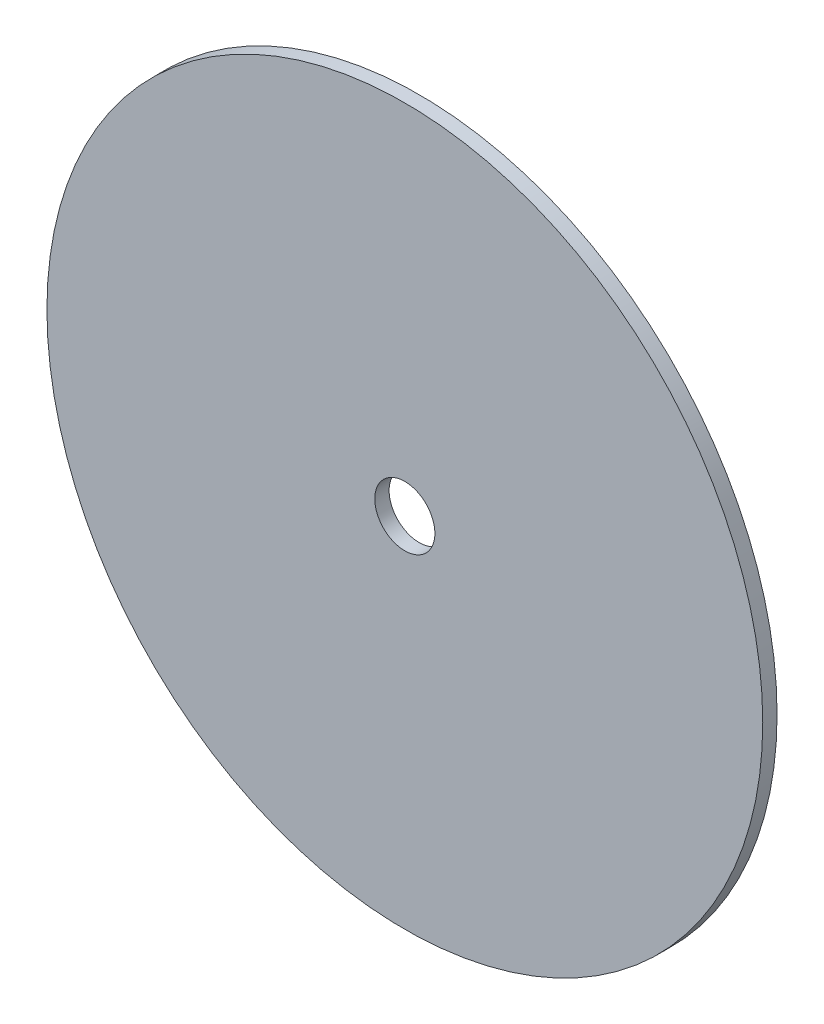
ISO-10303-21;
HEADER;
FILE_DESCRIPTION(('STEP AP214'),'2;1');
FILE_NAME('part.step','',(''),(''),'','','');
FILE_SCHEMA(('AUTOMOTIVE_DESIGN { 1 0 10303 214 1 1 1 1 }'));
ENDSEC;
DATA;
#1=APPLICATION_CONTEXT('core data for automotive mechanical design processes');
#2=APPLICATION_PROTOCOL_DEFINITION('international standard','automotive_design',2000,#1);
#3=PRODUCT_CONTEXT('',#1,'mechanical');
#4=PRODUCT('Part','Part','',(#3));
#5=PRODUCT_RELATED_PRODUCT_CATEGORY('part','',(#4));
#6=PRODUCT_DEFINITION_FORMATION('','',#4);
#7=PRODUCT_DEFINITION_CONTEXT('part definition',#1,'design');
#8=PRODUCT_DEFINITION('design','',#6,#7);
#9=PRODUCT_DEFINITION_SHAPE('','',#8);
#10=(LENGTH_UNIT() NAMED_UNIT(*) SI_UNIT(.MILLI.,.METRE.));
#11=(NAMED_UNIT(*) PLANE_ANGLE_UNIT() SI_UNIT($,.RADIAN.));
#12=(NAMED_UNIT(*) SI_UNIT($,.STERADIAN.) SOLID_ANGLE_UNIT());
#13=UNCERTAINTY_MEASURE_WITH_UNIT(LENGTH_MEASURE(1.E-05),#10,'distance_accuracy_value','');
#14=(GEOMETRIC_REPRESENTATION_CONTEXT(3) GLOBAL_UNCERTAINTY_ASSIGNED_CONTEXT((#13)) GLOBAL_UNIT_ASSIGNED_CONTEXT((#10,
#11,#12)) REPRESENTATION_CONTEXT('',''));
#15=CARTESIAN_POINT('',(0.,0.,0.));
#16=DIRECTION('',(0.,0.,1.));
#17=DIRECTION('',(1.,0.,0.));
#18=AXIS2_PLACEMENT_3D('',#15,#16,#17);
#19=CARTESIAN_POINT('',(0.,0.,6.));
#20=DIRECTION('',(0.,0.,1.));
#21=DIRECTION('',(1.,0.,0.));
#22=AXIS2_PLACEMENT_3D('',#19,#20,#21);
#23=PLANE('',#22);
#24=CARTESIAN_POINT('',(0.,0.,6.));
#25=DIRECTION('',(0.,0.,1.));
#26=DIRECTION('',(1.,0.,0.));
#27=AXIS2_PLACEMENT_3D('',#24,#25,#26);
#28=CIRCLE('',#27,150.);
#29=CARTESIAN_POINT('',(150.,0.,6.));
#30=VERTEX_POINT('',#29);
#31=EDGE_CURVE('E10',#30,#30,#28,.T.);
#32=ORIENTED_EDGE('',*,*,#31,.T.);
#33=EDGE_LOOP('',(#32));
#34=FACE_BOUND('',#33,.T.);
#35=CARTESIAN_POINT('',(0.,0.,6.));
#36=DIRECTION('',(0.,0.,1.));
#37=DIRECTION('',(1.,0.,0.));
#38=AXIS2_PLACEMENT_3D('',#35,#36,#37);
#39=CIRCLE('',#38,12.6);
#40=CARTESIAN_POINT('',(12.6,0.,6.));
#41=VERTEX_POINT('',#40);
#42=EDGE_CURVE('E42',#41,#41,#39,.T.);
#43=ORIENTED_EDGE('',*,*,#42,.F.);
#44=EDGE_LOOP('',(#43));
#45=FACE_BOUND('',#44,.T.);
#46=ADVANCED_FACE('F31',(#34,#45),#23,.T.);
#47=CARTESIAN_POINT('',(0.,0.,0.));
#48=DIRECTION('',(0.,0.,1.));
#49=DIRECTION('',(1.,0.,0.));
#50=AXIS2_PLACEMENT_3D('',#47,#48,#49);
#51=PLANE('',#50);
#52=CARTESIAN_POINT('',(0.,0.,0.));
#53=DIRECTION('',(0.,0.,1.));
#54=DIRECTION('',(1.,0.,0.));
#55=AXIS2_PLACEMENT_3D('',#52,#53,#54);
#56=CIRCLE('',#55,150.);
#57=CARTESIAN_POINT('',(150.,0.,0.));
#58=VERTEX_POINT('',#57);
#59=EDGE_CURVE('E35',#58,#58,#56,.T.);
#60=ORIENTED_EDGE('',*,*,#59,.F.);
#61=EDGE_LOOP('',(#60));
#62=FACE_BOUND('',#61,.T.);
#63=CARTESIAN_POINT('',(0.,0.,0.));
#64=DIRECTION('',(0.,0.,1.));
#65=DIRECTION('',(1.,0.,0.));
#66=AXIS2_PLACEMENT_3D('',#63,#64,#65);
#67=CIRCLE('',#66,12.6);
#68=CARTESIAN_POINT('',(12.6,0.,0.));
#69=VERTEX_POINT('',#68);
#70=EDGE_CURVE('E44',#69,#69,#67,.T.);
#71=ORIENTED_EDGE('',*,*,#70,.T.);
#72=EDGE_LOOP('',(#71));
#73=FACE_BOUND('',#72,.T.);
#74=ADVANCED_FACE('F54',(#62,#73),#51,.F.);
#75=CARTESIAN_POINT('',(0.,0.,6.));
#76=DIRECTION('',(0.,0.,-1.));
#77=DIRECTION('',(-1.,0.,0.));
#78=AXIS2_PLACEMENT_3D('',#75,#76,#77);
#79=CYLINDRICAL_SURFACE('',#78,150.);
#80=ORIENTED_EDGE('',*,*,#31,.F.);
#81=EDGE_LOOP('',(#80));
#82=FACE_BOUND('',#81,.T.);
#83=ORIENTED_EDGE('',*,*,#59,.T.);
#84=EDGE_LOOP('',(#83));
#85=FACE_BOUND('',#84,.T.);
#86=ADVANCED_FACE('F33',(#82,#85),#79,.T.);
#87=CARTESIAN_POINT('',(0.,0.,6.));
#88=DIRECTION('',(0.,0.,-1.));
#89=DIRECTION('',(-1.,0.,0.));
#90=AXIS2_PLACEMENT_3D('',#87,#88,#89);
#91=CYLINDRICAL_SURFACE('',#90,12.6);
#92=ORIENTED_EDGE('',*,*,#42,.T.);
#93=EDGE_LOOP('',(#92));
#94=FACE_BOUND('',#93,.T.);
#95=ORIENTED_EDGE('',*,*,#70,.F.);
#96=EDGE_LOOP('',(#95));
#97=FACE_BOUND('',#96,.T.);
#98=ADVANCED_FACE('F50',(#94,#97),#91,.F.);
#99=CLOSED_SHELL('',(#46,#74,#86,#98));
#100=MANIFOLD_SOLID_BREP('B2',#99);
#101=ADVANCED_BREP_SHAPE_REPRESENTATION('',(#18,#100),#14);
#102=SHAPE_DEFINITION_REPRESENTATION(#9,#101);
ENDSEC;
END-ISO-10303-21;
